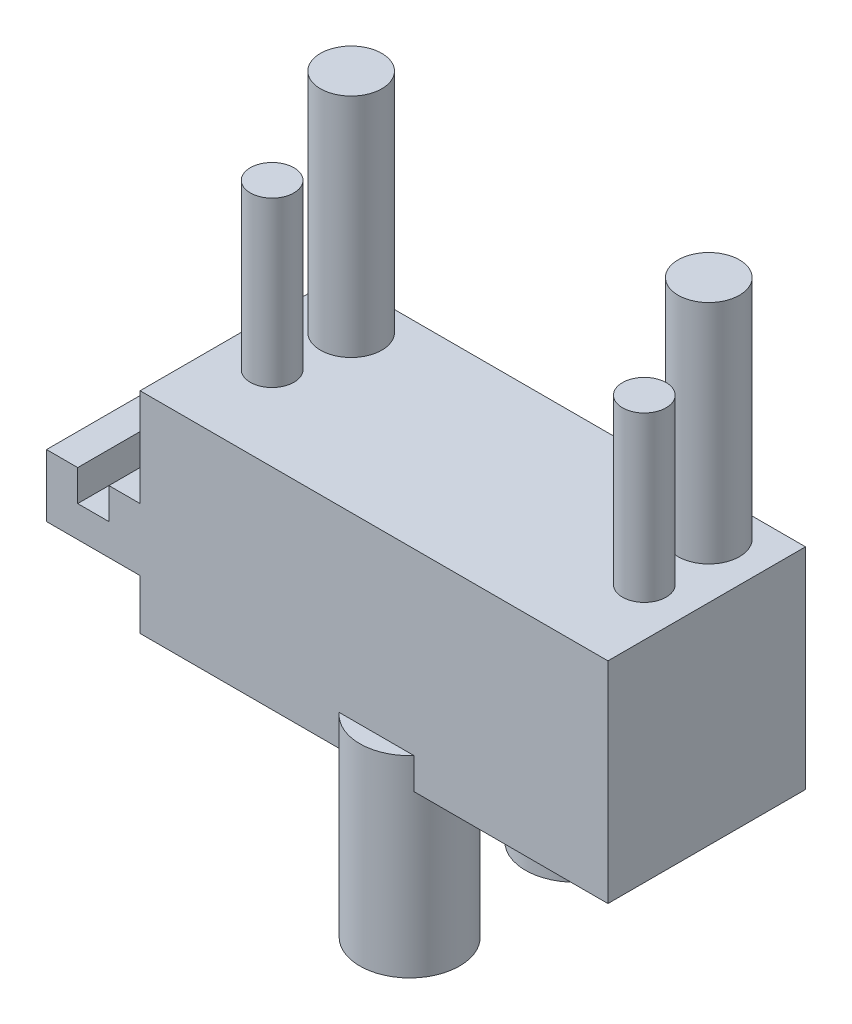
ISO-10303-21;
HEADER;
FILE_DESCRIPTION(('STEP AP214'),'2;1');
FILE_NAME('part.step','',(''),(''),'','','');
FILE_SCHEMA(('AUTOMOTIVE_DESIGN { 1 0 10303 214 1 1 1 1 }'));
ENDSEC;
DATA;
#1=APPLICATION_CONTEXT('core data for automotive mechanical design processes');
#2=APPLICATION_PROTOCOL_DEFINITION('international standard','automotive_design',2000,#1);
#3=PRODUCT_CONTEXT('',#1,'mechanical');
#4=PRODUCT('Part','Part','',(#3));
#5=PRODUCT_RELATED_PRODUCT_CATEGORY('part','',(#4));
#6=PRODUCT_DEFINITION_FORMATION('','',#4);
#7=PRODUCT_DEFINITION_CONTEXT('part definition',#1,'design');
#8=PRODUCT_DEFINITION('design','',#6,#7);
#9=PRODUCT_DEFINITION_SHAPE('','',#8);
#10=(LENGTH_UNIT() NAMED_UNIT(*) SI_UNIT(.MILLI.,.METRE.));
#11=(NAMED_UNIT(*) PLANE_ANGLE_UNIT() SI_UNIT($,.RADIAN.));
#12=(NAMED_UNIT(*) SI_UNIT($,.STERADIAN.) SOLID_ANGLE_UNIT());
#13=UNCERTAINTY_MEASURE_WITH_UNIT(LENGTH_MEASURE(1.E-05),#10,'distance_accuracy_value','');
#14=(GEOMETRIC_REPRESENTATION_CONTEXT(3) GLOBAL_UNCERTAINTY_ASSIGNED_CONTEXT((#13)) GLOBAL_UNIT_ASSIGNED_CONTEXT((#10,
#11,#12)) REPRESENTATION_CONTEXT('',''));
#15=CARTESIAN_POINT('',(0.,0.,0.));
#16=DIRECTION('',(0.,0.,1.));
#17=DIRECTION('',(1.,0.,0.));
#18=AXIS2_PLACEMENT_3D('',#15,#16,#17);
#19=CARTESIAN_POINT('',(-44.6857896698205,-0.589999999999999,27.0794807115573));
#20=DIRECTION('',(0.,-1.,0.));
#21=DIRECTION('',(0.,0.,-1.));
#22=AXIS2_PLACEMENT_3D('',#19,#20,#21);
#23=PLANE('',#22);
#24=DIRECTION('',(1.,0.,0.));
#25=VECTOR('',#24,1.);
#26=CARTESIAN_POINT('',(-44.6857896698205,-0.590000000000001,17.5794807115573));
#27=LINE('',#26,#25);
#28=CARTESIAN_POINT('',(-41.6857896698205,-0.590000000000001,17.5794807115573));
#29=VERTEX_POINT('',#28);
#30=CARTESIAN_POINT('',(-40.1857896698205,-0.590000000000001,17.5794807115573));
#31=VERTEX_POINT('',#30);
#32=EDGE_CURVE('E202',#29,#31,#27,.T.);
#33=ORIENTED_EDGE('',*,*,#32,.F.);
#34=DIRECTION('',(0.,0.,-1.));
#35=VECTOR('',#34,1.);
#36=CARTESIAN_POINT('',(-41.6857896698205,-0.589999999999999,27.0794807115573));
#37=LINE('',#36,#35);
#38=CARTESIAN_POINT('',(-41.6857896698205,-0.589999999999999,27.0794807115573));
#39=VERTEX_POINT('',#38);
#40=EDGE_CURVE('E152',#39,#29,#37,.T.);
#41=ORIENTED_EDGE('',*,*,#40,.F.);
#42=DIRECTION('',(1.,0.,0.));
#43=VECTOR('',#42,1.);
#44=CARTESIAN_POINT('',(-44.6857896698205,-0.589999999999999,27.0794807115573));
#45=LINE('',#44,#43);
#46=CARTESIAN_POINT('',(-40.1857896698205,-0.59,27.0794807115573));
#47=VERTEX_POINT('',#46);
#48=EDGE_CURVE('E205',#39,#47,#45,.T.);
#49=ORIENTED_EDGE('',*,*,#48,.T.);
#50=DIRECTION('',(0.,0.,-1.));
#51=VECTOR('',#50,1.);
#52=CARTESIAN_POINT('',(-40.1857896698205,-0.589999999999999,27.0794807115573));
#53=LINE('',#52,#51);
#54=EDGE_CURVE('E178',#47,#31,#53,.T.);
#55=ORIENTED_EDGE('',*,*,#54,.T.);
#56=EDGE_LOOP('',(#33,#41,#49,#55));
#57=FACE_BOUND('',#56,.T.);
#58=ADVANCED_FACE('F35',(#57),#23,.F.);
#59=CARTESIAN_POINT('',(-40.1857896698205,1.5,24.5794807115573));
#60=DIRECTION('',(1.,0.,0.));
#61=DIRECTION('',(0.,0.,-1.));
#62=AXIS2_PLACEMENT_3D('',#59,#60,#61);
#63=PLANE('',#62);
#64=DIRECTION('',(0.,0.,1.));
#65=VECTOR('',#64,1.);
#66=CARTESIAN_POINT('',(-40.1857896698205,-3.59,27.0794807115573));
#67=LINE('',#66,#65);
#68=CARTESIAN_POINT('',(-40.1857896698205,-3.59,17.5794807115573));
#69=VERTEX_POINT('',#68);
#70=CARTESIAN_POINT('',(-40.1857896698205,-3.59,27.0794807115573));
#71=VERTEX_POINT('',#70);
#72=EDGE_CURVE('E187',#69,#71,#67,.T.);
#73=ORIENTED_EDGE('',*,*,#72,.F.);
#74=DIRECTION('',(0.,-1.,0.));
#75=VECTOR('',#74,1.);
#76=CARTESIAN_POINT('',(-40.1857896698205,1.5,17.5794807115573));
#77=LINE('',#76,#75);
#78=CARTESIAN_POINT('',(-40.1857896698205,-6.,17.5794807115573));
#79=VERTEX_POINT('',#78);
#80=EDGE_CURVE('E278',#69,#79,#77,.T.);
#81=ORIENTED_EDGE('',*,*,#80,.T.);
#82=DIRECTION('',(0.,0.,1.));
#83=VECTOR('',#82,1.);
#84=CARTESIAN_POINT('',(-40.1857896698205,-6.,0.));
#85=LINE('',#84,#83);
#86=CARTESIAN_POINT('',(-40.1857896698205,-6.,27.0794807115573));
#87=VERTEX_POINT('',#86);
#88=EDGE_CURVE('E248',#79,#87,#85,.T.);
#89=ORIENTED_EDGE('',*,*,#88,.T.);
#90=DIRECTION('',(0.,-1.,0.));
#91=VECTOR('',#90,1.);
#92=CARTESIAN_POINT('',(-40.1857896698205,1.5,27.0794807115573));
#93=LINE('',#92,#91);
#94=EDGE_CURVE('E58',#71,#87,#93,.T.);
#95=ORIENTED_EDGE('',*,*,#94,.F.);
#96=EDGE_LOOP('',(#73,#81,#89,#95));
#97=FACE_BOUND('',#96,.T.);
#98=ADVANCED_FACE('F37',(#97),#63,.F.);
#99=ORIENTED_EDGE('',*,*,#54,.F.);
#100=CARTESIAN_POINT('',(-40.1857896698205,4.11,27.0794807115573));
#101=VERTEX_POINT('',#100);
#102=EDGE_CURVE('E262',#101,#47,#93,.T.);
#103=ORIENTED_EDGE('',*,*,#102,.F.);
#104=DIRECTION('',(0.,0.,1.));
#105=VECTOR('',#104,1.);
#106=CARTESIAN_POINT('',(-40.1857896698205,4.11,17.5794807115573));
#107=LINE('',#106,#105);
#108=CARTESIAN_POINT('',(-40.1857896698205,4.11,17.5794807115573));
#109=VERTEX_POINT('',#108);
#110=EDGE_CURVE('E226',#109,#101,#107,.T.);
#111=ORIENTED_EDGE('',*,*,#110,.F.);
#112=EDGE_CURVE('E279',#109,#31,#77,.T.);
#113=ORIENTED_EDGE('',*,*,#112,.T.);
#114=EDGE_LOOP('',(#99,#103,#111,#113));
#115=FACE_BOUND('',#114,.T.);
#116=ADVANCED_FACE('F335',(#115),#63,.F.);
#117=CARTESIAN_POINT('',(-37.5357896698205,15.,19.5794807115573));
#118=DIRECTION('',(0.,-1.,0.));
#119=DIRECTION('',(0.,0.,-1.));
#120=AXIS2_PLACEMENT_3D('',#117,#118,#119);
#121=CYLINDRICAL_SURFACE('',#120,1.475);
#122=CARTESIAN_POINT('',(-37.5357896698205,4.11,19.5794807115573));
#123=DIRECTION('',(0.,1.,0.));
#124=DIRECTION('',(0.,0.,1.));
#125=AXIS2_PLACEMENT_3D('',#122,#123,#124);
#126=CIRCLE('',#125,1.475);
#127=CARTESIAN_POINT('',(-37.5357896698205,4.11,21.0544807115573));
#128=VERTEX_POINT('',#127);
#129=EDGE_CURVE('E245',#128,#128,#126,.T.);
#130=ORIENTED_EDGE('',*,*,#129,.T.);
#131=EDGE_LOOP('',(#130));
#132=FACE_BOUND('',#131,.T.);
#133=CARTESIAN_POINT('',(-37.5357896698205,15.,19.5794807115573));
#134=DIRECTION('',(0.,1.,0.));
#135=DIRECTION('',(0.,0.,1.));
#136=AXIS2_PLACEMENT_3D('',#133,#134,#135);
#137=CIRCLE('',#136,1.475);
#138=CARTESIAN_POINT('',(-37.5357896698205,15.,21.0544807115573));
#139=VERTEX_POINT('',#138);
#140=EDGE_CURVE('E275',#139,#139,#137,.T.);
#141=ORIENTED_EDGE('',*,*,#140,.F.);
#142=EDGE_LOOP('',(#141));
#143=FACE_BOUND('',#142,.T.);
#144=ADVANCED_FACE('F413',(#132,#143),#121,.T.);
#145=CARTESIAN_POINT('',(-37.5357896698205,15.,19.5794807115573));
#146=DIRECTION('',(0.,1.,0.));
#147=DIRECTION('',(0.,0.,1.));
#148=AXIS2_PLACEMENT_3D('',#145,#146,#147);
#149=PLANE('',#148);
#150=ORIENTED_EDGE('',*,*,#140,.T.);
#151=EDGE_LOOP('',(#150));
#152=FACE_BOUND('',#151,.T.);
#153=ADVANCED_FACE('F567',(#152),#149,.T.);
#154=CARTESIAN_POINT('',(0.,4.11,0.));
#155=DIRECTION('',(0.,1.,0.));
#156=DIRECTION('',(0.,0.,1.));
#157=AXIS2_PLACEMENT_3D('',#154,#155,#156);
#158=PLANE('',#157);
#159=ORIENTED_EDGE('',*,*,#129,.F.);
#160=EDGE_LOOP('',(#159));
#161=FACE_BOUND('',#160,.T.);
#162=CARTESIAN_POINT('',(-20.3357896698205,4.11,19.5794807115573));
#163=DIRECTION('',(0.,1.,0.));
#164=DIRECTION('',(0.,0.,1.));
#165=AXIS2_PLACEMENT_3D('',#162,#163,#164);
#166=CIRCLE('',#165,1.475);
#167=CARTESIAN_POINT('',(-20.3357896698205,4.11,21.0544807115573));
#168=VERTEX_POINT('',#167);
#169=EDGE_CURVE('E242',#168,#168,#166,.T.);
#170=ORIENTED_EDGE('',*,*,#169,.F.);
#171=EDGE_LOOP('',(#170));
#172=FACE_BOUND('',#171,.T.);
#173=CARTESIAN_POINT('',(-37.8857896698205,4.11,23.0294807115573));
#174=DIRECTION('',(0.,1.,0.));
#175=DIRECTION('',(0.,0.,1.));
#176=AXIS2_PLACEMENT_3D('',#173,#174,#175);
#177=CIRCLE('',#176,1.05);
#178=CARTESIAN_POINT('',(-37.8857896698205,4.11,24.0794807115573));
#179=VERTEX_POINT('',#178);
#180=EDGE_CURVE('E239',#179,#179,#177,.T.);
#181=ORIENTED_EDGE('',*,*,#180,.F.);
#182=EDGE_LOOP('',(#181));
#183=FACE_BOUND('',#182,.T.);
#184=CARTESIAN_POINT('',(-19.9857896698205,4.11,23.0294807115573));
#185=DIRECTION('',(0.,1.,0.));
#186=DIRECTION('',(0.,0.,1.));
#187=AXIS2_PLACEMENT_3D('',#184,#185,#186);
#188=CIRCLE('',#187,1.05);
#189=CARTESIAN_POINT('',(-19.9857896698205,4.11,24.0794807115573));
#190=VERTEX_POINT('',#189);
#191=EDGE_CURVE('E238',#190,#190,#188,.T.);
#192=ORIENTED_EDGE('',*,*,#191,.F.);
#193=EDGE_LOOP('',(#192));
#194=FACE_BOUND('',#193,.T.);
#195=ORIENTED_EDGE('',*,*,#110,.T.);
#196=DIRECTION('',(1.,0.,0.));
#197=VECTOR('',#196,1.);
#198=CARTESIAN_POINT('',(-40.1857896698205,4.11,27.0794807115573));
#199=LINE('',#198,#197);
#200=CARTESIAN_POINT('',(-17.6857896698205,4.11,27.0794807115573));
#201=VERTEX_POINT('',#200);
#202=EDGE_CURVE('E229',#101,#201,#199,.T.);
#203=ORIENTED_EDGE('',*,*,#202,.T.);
#204=DIRECTION('',(0.,0.,-1.));
#205=VECTOR('',#204,1.);
#206=CARTESIAN_POINT('',(-17.6857896698205,4.11,17.5794807115573));
#207=LINE('',#206,#205);
#208=CARTESIAN_POINT('',(-17.6857896698205,4.11,17.5794807115573));
#209=VERTEX_POINT('',#208);
#210=EDGE_CURVE('E232',#201,#209,#207,.T.);
#211=ORIENTED_EDGE('',*,*,#210,.T.);
#212=DIRECTION('',(-1.,0.,0.));
#213=VECTOR('',#212,1.);
#214=CARTESIAN_POINT('',(-40.1857896698205,4.11,17.5794807115573));
#215=LINE('',#214,#213);
#216=EDGE_CURVE('E235',#209,#109,#215,.T.);
#217=ORIENTED_EDGE('',*,*,#216,.T.);
#218=EDGE_LOOP('',(#195,#203,#211,#217));
#219=FACE_BOUND('',#218,.T.);
#220=ADVANCED_FACE('F338',(#161,#172,#183,#194,#219),#158,.T.);
#221=CARTESIAN_POINT('',(-19.9857896698205,12.,23.0294807115573));
#222=DIRECTION('',(0.,1.,0.));
#223=DIRECTION('',(0.,0.,1.));
#224=AXIS2_PLACEMENT_3D('',#221,#222,#223);
#225=PLANE('',#224);
#226=CARTESIAN_POINT('',(-19.9857896698205,12.,23.0294807115573));
#227=DIRECTION('',(0.,1.,0.));
#228=DIRECTION('',(0.,0.,1.));
#229=AXIS2_PLACEMENT_3D('',#226,#227,#228);
#230=CIRCLE('',#229,1.05);
#231=CARTESIAN_POINT('',(-19.9857896698205,12.,24.0794807115573));
#232=VERTEX_POINT('',#231);
#233=EDGE_CURVE('E265',#232,#232,#230,.T.);
#234=ORIENTED_EDGE('',*,*,#233,.T.);
#235=EDGE_LOOP('',(#234));
#236=FACE_BOUND('',#235,.T.);
#237=ADVANCED_FACE('F552',(#236),#225,.T.);
#238=CARTESIAN_POINT('',(-19.9857896698205,12.,23.0294807115573));
#239=DIRECTION('',(0.,-1.,0.));
#240=DIRECTION('',(0.,0.,-1.));
#241=AXIS2_PLACEMENT_3D('',#238,#239,#240);
#242=CYLINDRICAL_SURFACE('',#241,1.05);
#243=ORIENTED_EDGE('',*,*,#191,.T.);
#244=EDGE_LOOP('',(#243));
#245=FACE_BOUND('',#244,.T.);
#246=ORIENTED_EDGE('',*,*,#233,.F.);
#247=EDGE_LOOP('',(#246));
#248=FACE_BOUND('',#247,.T.);
#249=ADVANCED_FACE('F544',(#245,#248),#242,.T.);
#250=CARTESIAN_POINT('',(-37.8857896698205,12.,23.0294807115573));
#251=DIRECTION('',(0.,1.,0.));
#252=DIRECTION('',(0.,0.,1.));
#253=AXIS2_PLACEMENT_3D('',#250,#251,#252);
#254=PLANE('',#253);
#255=CARTESIAN_POINT('',(-37.8857896698205,12.,23.0294807115573));
#256=DIRECTION('',(0.,1.,0.));
#257=DIRECTION('',(0.,0.,1.));
#258=AXIS2_PLACEMENT_3D('',#255,#256,#257);
#259=CIRCLE('',#258,1.05);
#260=CARTESIAN_POINT('',(-37.8857896698205,12.,24.0794807115573));
#261=VERTEX_POINT('',#260);
#262=EDGE_CURVE('E269',#261,#261,#259,.T.);
#263=ORIENTED_EDGE('',*,*,#262,.T.);
#264=EDGE_LOOP('',(#263));
#265=FACE_BOUND('',#264,.T.);
#266=ADVANCED_FACE('F536',(#265),#254,.T.);
#267=CARTESIAN_POINT('',(-37.8857896698205,12.,23.0294807115573));
#268=DIRECTION('',(0.,-1.,0.));
#269=DIRECTION('',(0.,0.,-1.));
#270=AXIS2_PLACEMENT_3D('',#267,#268,#269);
#271=CYLINDRICAL_SURFACE('',#270,1.05);
#272=ORIENTED_EDGE('',*,*,#180,.T.);
#273=EDGE_LOOP('',(#272));
#274=FACE_BOUND('',#273,.T.);
#275=ORIENTED_EDGE('',*,*,#262,.F.);
#276=EDGE_LOOP('',(#275));
#277=FACE_BOUND('',#276,.T.);
#278=ADVANCED_FACE('F527',(#274,#277),#271,.T.);
#279=CARTESIAN_POINT('',(-20.3357896698205,15.,19.5794807115573));
#280=DIRECTION('',(0.,1.,0.));
#281=DIRECTION('',(0.,0.,1.));
#282=AXIS2_PLACEMENT_3D('',#279,#280,#281);
#283=PLANE('',#282);
#284=CARTESIAN_POINT('',(-20.3357896698205,15.,19.5794807115573));
#285=DIRECTION('',(0.,1.,0.));
#286=DIRECTION('',(0.,0.,1.));
#287=AXIS2_PLACEMENT_3D('',#284,#285,#286);
#288=CIRCLE('',#287,1.475);
#289=CARTESIAN_POINT('',(-20.3357896698205,15.,21.0544807115573));
#290=VERTEX_POINT('',#289);
#291=EDGE_CURVE('E272',#290,#290,#288,.T.);
#292=ORIENTED_EDGE('',*,*,#291,.T.);
#293=EDGE_LOOP('',(#292));
#294=FACE_BOUND('',#293,.T.);
#295=ADVANCED_FACE('F518',(#294),#283,.T.);
#296=CARTESIAN_POINT('',(-20.3357896698205,15.,19.5794807115573));
#297=DIRECTION('',(0.,-1.,0.));
#298=DIRECTION('',(0.,0.,-1.));
#299=AXIS2_PLACEMENT_3D('',#296,#297,#298);
#300=CYLINDRICAL_SURFACE('',#299,1.475);
#301=ORIENTED_EDGE('',*,*,#169,.T.);
#302=EDGE_LOOP('',(#301));
#303=FACE_BOUND('',#302,.T.);
#304=ORIENTED_EDGE('',*,*,#291,.F.);
#305=EDGE_LOOP('',(#304));
#306=FACE_BOUND('',#305,.T.);
#307=ADVANCED_FACE('F508',(#303,#306),#300,.T.);
#308=CARTESIAN_POINT('',(0.,-6.,0.));
#309=DIRECTION('',(0.,-1.,0.));
#310=DIRECTION('',(0.,0.,-1.));
#311=AXIS2_PLACEMENT_3D('',#308,#309,#310);
#312=PLANE('',#311);
#313=CARTESIAN_POINT('',(-28.8107896698205,-6.,17.5194807115573));
#314=DIRECTION('',(0.,-1.,0.));
#315=DIRECTION('',(0.,0.,-1.));
#316=AXIS2_PLACEMENT_3D('',#313,#314,#315);
#317=CIRCLE('',#316,2.4);
#318=CARTESIAN_POINT('',(-26.4115397870447,-6.,17.5794807115573));
#319=VERTEX_POINT('',#318);
#320=CARTESIAN_POINT('',(-31.2100395525964,-6.,17.5794807115573));
#321=VERTEX_POINT('',#320);
#322=EDGE_CURVE('E215',#319,#321,#317,.T.);
#323=ORIENTED_EDGE('',*,*,#322,.F.);
#324=DIRECTION('',(1.,0.,0.));
#325=VECTOR('',#324,1.);
#326=CARTESIAN_POINT('',(0.,-6.,17.5794807115573));
#327=LINE('',#326,#325);
#328=CARTESIAN_POINT('',(-17.6857896698205,-6.,17.5794807115573));
#329=VERTEX_POINT('',#328);
#330=EDGE_CURVE('E250',#319,#329,#327,.T.);
#331=ORIENTED_EDGE('',*,*,#330,.T.);
#332=DIRECTION('',(0.,0.,1.));
#333=VECTOR('',#332,1.);
#334=CARTESIAN_POINT('',(-17.6857896698205,-6.,0.));
#335=LINE('',#334,#333);
#336=CARTESIAN_POINT('',(-17.6857896698205,-6.,27.0794807115573));
#337=VERTEX_POINT('',#336);
#338=EDGE_CURVE('E254',#329,#337,#335,.T.);
#339=ORIENTED_EDGE('',*,*,#338,.T.);
#340=DIRECTION('',(-1.,0.,0.));
#341=VECTOR('',#340,1.);
#342=CARTESIAN_POINT('',(0.,-6.,27.0794807115573));
#343=LINE('',#342,#341);
#344=CARTESIAN_POINT('',(-27.0130410778311,-6.,27.0794807115573));
#345=VERTEX_POINT('',#344);
#346=EDGE_CURVE('E258',#337,#345,#343,.T.);
#347=ORIENTED_EDGE('',*,*,#346,.T.);
#348=CARTESIAN_POINT('',(-28.8107896698205,-6.,25.4894807115573));
#349=DIRECTION('',(0.,-1.,0.));
#350=DIRECTION('',(0.,0.,-1.));
#351=AXIS2_PLACEMENT_3D('',#348,#349,#350);
#352=CIRCLE('',#351,2.4);
#353=CARTESIAN_POINT('',(-30.60853826181,-6.,27.0794807115573));
#354=VERTEX_POINT('',#353);
#355=EDGE_CURVE('E224',#354,#345,#352,.T.);
#356=ORIENTED_EDGE('',*,*,#355,.F.);
#357=EDGE_CURVE('E257',#354,#87,#343,.T.);
#358=ORIENTED_EDGE('',*,*,#357,.T.);
#359=ORIENTED_EDGE('',*,*,#88,.F.);
#360=EDGE_CURVE('E251',#79,#321,#327,.T.);
#361=ORIENTED_EDGE('',*,*,#360,.T.);
#362=EDGE_LOOP('',(#323,#331,#339,#347,#356,#358,#359,#361));
#363=FACE_BOUND('',#362,.T.);
#364=ADVANCED_FACE('F309',(#363),#312,.T.);
#365=CARTESIAN_POINT('',(-40.1857896698205,1.5,17.5794807115573));
#366=DIRECTION('',(0.,0.,1.));
#367=DIRECTION('',(1.,0.,0.));
#368=AXIS2_PLACEMENT_3D('',#365,#366,#367);
#369=PLANE('',#368);
#370=DIRECTION('',(-1.,0.,0.));
#371=VECTOR('',#370,1.);
#372=CARTESIAN_POINT('',(-41.6857896698205,-2.09,17.5794807115573));
#373=LINE('',#372,#371);
#374=CARTESIAN_POINT('',(-41.6857896698205,-2.09,17.5794807115573));
#375=VERTEX_POINT('',#374);
#376=CARTESIAN_POINT('',(-43.1857896698205,-2.09,17.5794807115573));
#377=VERTEX_POINT('',#376);
#378=EDGE_CURVE('E162',#375,#377,#373,.T.);
#379=ORIENTED_EDGE('',*,*,#378,.F.);
#380=DIRECTION('',(0.,1.,0.));
#381=VECTOR('',#380,1.);
#382=CARTESIAN_POINT('',(-41.6857896698205,-2.09,17.5794807115573));
#383=LINE('',#382,#381);
#384=EDGE_CURVE('E146',#375,#29,#383,.T.);
#385=ORIENTED_EDGE('',*,*,#384,.T.);
#386=ORIENTED_EDGE('',*,*,#32,.T.);
#387=ORIENTED_EDGE('',*,*,#112,.F.);
#388=ORIENTED_EDGE('',*,*,#216,.F.);
#389=DIRECTION('',(0.,-1.,0.));
#390=VECTOR('',#389,1.);
#391=CARTESIAN_POINT('',(-17.6857896698205,1.5,17.5794807115573));
#392=LINE('',#391,#390);
#393=EDGE_CURVE('E282',#209,#329,#392,.T.);
#394=ORIENTED_EDGE('',*,*,#393,.T.);
#395=ORIENTED_EDGE('',*,*,#330,.F.);
#396=DIRECTION('',(0.,-1.,0.));
#397=VECTOR('',#396,1.);
#398=CARTESIAN_POINT('',(-26.4115397870447,-4.5,17.5794807115573));
#399=LINE('',#398,#397);
#400=CARTESIAN_POINT('',(-26.4115397870447,-4.5,17.5794807115573));
#401=VERTEX_POINT('',#400);
#402=EDGE_CURVE('E43',#319,#401,#399,.F.);
#403=ORIENTED_EDGE('',*,*,#402,.T.);
#404=DIRECTION('',(1.,0.,0.));
#405=VECTOR('',#404,1.);
#406=CARTESIAN_POINT('',(-40.1857896698205,-4.5,17.5794807115573));
#407=LINE('',#406,#405);
#408=CARTESIAN_POINT('',(-31.2100395525964,-4.5,17.5794807115573));
#409=VERTEX_POINT('',#408);
#410=EDGE_CURVE('E295',#409,#401,#407,.T.);
#411=ORIENTED_EDGE('',*,*,#410,.F.);
#412=DIRECTION('',(0.,-1.,0.));
#413=VECTOR('',#412,1.);
#414=CARTESIAN_POINT('',(-31.2100395525964,-4.5,17.5794807115573));
#415=LINE('',#414,#413);
#416=EDGE_CURVE('E11',#409,#321,#415,.T.);
#417=ORIENTED_EDGE('',*,*,#416,.T.);
#418=ORIENTED_EDGE('',*,*,#360,.F.);
#419=ORIENTED_EDGE('',*,*,#80,.F.);
#420=DIRECTION('',(1.,0.,0.));
#421=VECTOR('',#420,1.);
#422=CARTESIAN_POINT('',(-44.6857896698205,-3.59,17.5794807115573));
#423=LINE('',#422,#421);
#424=CARTESIAN_POINT('',(-44.6857896698205,-3.59,17.5794807115573));
#425=VERTEX_POINT('',#424);
#426=EDGE_CURVE('E199',#425,#69,#423,.T.);
#427=ORIENTED_EDGE('',*,*,#426,.F.);
#428=DIRECTION('',(0.,-1.,0.));
#429=VECTOR('',#428,1.);
#430=CARTESIAN_POINT('',(-44.6857896698205,-0.590000000000001,17.5794807115573));
#431=LINE('',#430,#429);
#432=CARTESIAN_POINT('',(-44.6857896698205,-0.590000000000001,17.5794807115573));
#433=VERTEX_POINT('',#432);
#434=EDGE_CURVE('E189',#433,#425,#431,.T.);
#435=ORIENTED_EDGE('',*,*,#434,.F.);
#436=CARTESIAN_POINT('',(-43.1857896698205,-0.590000000000001,17.5794807115573));
#437=VERTEX_POINT('',#436);
#438=EDGE_CURVE('E203',#433,#437,#27,.T.);
#439=ORIENTED_EDGE('',*,*,#438,.T.);
#440=DIRECTION('',(0.,1.,0.));
#441=VECTOR('',#440,1.);
#442=CARTESIAN_POINT('',(-43.1857896698205,-2.09,17.5794807115573));
#443=LINE('',#442,#441);
#444=EDGE_CURVE('E50',#377,#437,#443,.T.);
#445=ORIENTED_EDGE('',*,*,#444,.F.);
#446=EDGE_LOOP('',(#379,#385,#386,#387,#388,#394,#395,#403,#411,#417,#418,#419,#427,#435,#439,#445));
#447=FACE_BOUND('',#446,.T.);
#448=ADVANCED_FACE('F167',(#447),#369,.F.);
#449=CARTESIAN_POINT('',(0.,1.5,27.0794807115573));
#450=DIRECTION('',(0.,0.,1.));
#451=DIRECTION('',(1.,0.,0.));
#452=AXIS2_PLACEMENT_3D('',#449,#450,#451);
#453=PLANE('',#452);
#454=DIRECTION('',(0.,1.,0.));
#455=VECTOR('',#454,1.);
#456=CARTESIAN_POINT('',(-41.6857896698205,-2.09,27.0794807115573));
#457=LINE('',#456,#455);
#458=CARTESIAN_POINT('',(-41.6857896698205,-2.09,27.0794807115573));
#459=VERTEX_POINT('',#458);
#460=EDGE_CURVE('E176',#459,#39,#457,.T.);
#461=ORIENTED_EDGE('',*,*,#460,.F.);
#462=DIRECTION('',(1.,0.,0.));
#463=VECTOR('',#462,1.);
#464=CARTESIAN_POINT('',(-41.6857896698205,-2.09,27.0794807115573));
#465=LINE('',#464,#463);
#466=CARTESIAN_POINT('',(-43.1857896698205,-2.09,27.0794807115573));
#467=VERTEX_POINT('',#466);
#468=EDGE_CURVE('E156',#467,#459,#465,.T.);
#469=ORIENTED_EDGE('',*,*,#468,.F.);
#470=DIRECTION('',(0.,1.,0.));
#471=VECTOR('',#470,1.);
#472=CARTESIAN_POINT('',(-43.1857896698205,-2.09,27.0794807115573));
#473=LINE('',#472,#471);
#474=CARTESIAN_POINT('',(-43.1857896698205,-0.589999999999999,27.0794807115573));
#475=VERTEX_POINT('',#474);
#476=EDGE_CURVE('E179',#467,#475,#473,.T.);
#477=ORIENTED_EDGE('',*,*,#476,.T.);
#478=CARTESIAN_POINT('',(-44.6857896698205,-0.589999999999999,27.0794807115573));
#479=VERTEX_POINT('',#478);
#480=EDGE_CURVE('E206',#479,#475,#45,.T.);
#481=ORIENTED_EDGE('',*,*,#480,.F.);
#482=DIRECTION('',(0.,1.,0.));
#483=VECTOR('',#482,1.);
#484=CARTESIAN_POINT('',(-44.6857896698205,-0.589999999999999,27.0794807115573));
#485=LINE('',#484,#483);
#486=CARTESIAN_POINT('',(-44.6857896698205,-3.59,27.0794807115573));
#487=VERTEX_POINT('',#486);
#488=EDGE_CURVE('E183',#487,#479,#485,.T.);
#489=ORIENTED_EDGE('',*,*,#488,.F.);
#490=DIRECTION('',(1.,0.,0.));
#491=VECTOR('',#490,1.);
#492=CARTESIAN_POINT('',(-44.6857896698205,-3.59,27.0794807115573));
#493=LINE('',#492,#491);
#494=EDGE_CURVE('E193',#487,#71,#493,.T.);
#495=ORIENTED_EDGE('',*,*,#494,.T.);
#496=ORIENTED_EDGE('',*,*,#94,.T.);
#497=ORIENTED_EDGE('',*,*,#357,.F.);
#498=DIRECTION('',(0.,-1.,0.));
#499=VECTOR('',#498,1.);
#500=CARTESIAN_POINT('',(-30.60853826181,-4.5,27.0794807115573));
#501=LINE('',#500,#499);
#502=CARTESIAN_POINT('',(-30.60853826181,-4.5,27.0794807115573));
#503=VERTEX_POINT('',#502);
#504=EDGE_CURVE('E293',#503,#354,#501,.T.);
#505=ORIENTED_EDGE('',*,*,#504,.F.);
#506=DIRECTION('',(1.,0.,0.));
#507=VECTOR('',#506,1.);
#508=CARTESIAN_POINT('',(0.,-4.5,27.0794807115573));
#509=LINE('',#508,#507);
#510=CARTESIAN_POINT('',(-27.0130410778311,-4.5,27.0794807115573));
#511=VERTEX_POINT('',#510);
#512=EDGE_CURVE('E285',#503,#511,#509,.T.);
#513=ORIENTED_EDGE('',*,*,#512,.T.);
#514=DIRECTION('',(0.,-1.,0.));
#515=VECTOR('',#514,1.);
#516=CARTESIAN_POINT('',(-27.0130410778311,-4.5,27.0794807115573));
#517=LINE('',#516,#515);
#518=EDGE_CURVE('E290',#345,#511,#517,.F.);
#519=ORIENTED_EDGE('',*,*,#518,.F.);
#520=ORIENTED_EDGE('',*,*,#346,.F.);
#521=DIRECTION('',(0.,-1.,0.));
#522=VECTOR('',#521,1.);
#523=CARTESIAN_POINT('',(-17.6857896698205,1.5,27.0794807115573));
#524=LINE('',#523,#522);
#525=EDGE_CURVE('E261',#201,#337,#524,.T.);
#526=ORIENTED_EDGE('',*,*,#525,.F.);
#527=ORIENTED_EDGE('',*,*,#202,.F.);
#528=ORIENTED_EDGE('',*,*,#102,.T.);
#529=ORIENTED_EDGE('',*,*,#48,.F.);
#530=EDGE_LOOP('',(#461,#469,#477,#481,#489,#495,#496,#497,#505,#513,#519,#520,#526,#527,#528,#529));
#531=FACE_BOUND('',#530,.T.);
#532=ADVANCED_FACE('F328',(#531),#453,.T.);
#533=CARTESIAN_POINT('',(-17.6857896698205,1.5,24.5794807115573));
#534=DIRECTION('',(-1.,0.,0.));
#535=DIRECTION('',(0.,0.,1.));
#536=AXIS2_PLACEMENT_3D('',#533,#534,#535);
#537=PLANE('',#536);
#538=ORIENTED_EDGE('',*,*,#393,.F.);
#539=ORIENTED_EDGE('',*,*,#210,.F.);
#540=ORIENTED_EDGE('',*,*,#525,.T.);
#541=ORIENTED_EDGE('',*,*,#338,.F.);
#542=EDGE_LOOP('',(#538,#539,#540,#541));
#543=FACE_BOUND('',#542,.T.);
#544=ADVANCED_FACE('F342',(#543),#537,.F.);
#545=CARTESIAN_POINT('',(-28.8107896698205,-4.5,25.4894807115573));
#546=DIRECTION('',(0.,-1.,0.));
#547=DIRECTION('',(0.,0.,-1.));
#548=AXIS2_PLACEMENT_3D('',#545,#546,#547);
#549=CYLINDRICAL_SURFACE('',#548,2.4);
#550=CARTESIAN_POINT('',(-28.8107896698205,-4.5,25.4894807115573));
#551=DIRECTION('',(0.,-1.,0.));
#552=DIRECTION('',(0.,0.,-1.));
#553=AXIS2_PLACEMENT_3D('',#550,#551,#552);
#554=CIRCLE('',#553,2.4);
#555=EDGE_CURVE('E221',#511,#503,#554,.T.);
#556=ORIENTED_EDGE('',*,*,#555,.T.);
#557=ORIENTED_EDGE('',*,*,#504,.T.);
#558=ORIENTED_EDGE('',*,*,#355,.T.);
#559=ORIENTED_EDGE('',*,*,#518,.T.);
#560=EDGE_LOOP('',(#556,#557,#558,#559));
#561=FACE_BOUND('',#560,.T.);
#562=CARTESIAN_POINT('',(-28.8107896698205,-13.76,25.4894807115573));
#563=DIRECTION('',(0.,-1.,0.));
#564=DIRECTION('',(0.,0.,-1.));
#565=AXIS2_PLACEMENT_3D('',#562,#563,#564);
#566=CIRCLE('',#565,2.4);
#567=CARTESIAN_POINT('',(-28.8107896698205,-13.76,23.0894807115573));
#568=VERTEX_POINT('',#567);
#569=EDGE_CURVE('E218',#568,#568,#566,.T.);
#570=ORIENTED_EDGE('',*,*,#569,.F.);
#571=EDGE_LOOP('',(#570));
#572=FACE_BOUND('',#571,.T.);
#573=ADVANCED_FACE('F347',(#561,#572),#549,.T.);
#574=CARTESIAN_POINT('',(-28.8107896698205,-4.5,25.4894807115573));
#575=DIRECTION('',(0.,-1.,0.));
#576=DIRECTION('',(0.,0.,-1.));
#577=AXIS2_PLACEMENT_3D('',#574,#575,#576);
#578=PLANE('',#577);
#579=ORIENTED_EDGE('',*,*,#512,.F.);
#580=ORIENTED_EDGE('',*,*,#555,.F.);
#581=EDGE_LOOP('',(#579,#580));
#582=FACE_BOUND('',#581,.T.);
#583=ADVANCED_FACE('F350',(#582),#578,.F.);
#584=CARTESIAN_POINT('',(-28.8107896698205,-13.76,25.4894807115573));
#585=DIRECTION('',(0.,-1.,0.));
#586=DIRECTION('',(0.,0.,-1.));
#587=AXIS2_PLACEMENT_3D('',#584,#585,#586);
#588=PLANE('',#587);
#589=ORIENTED_EDGE('',*,*,#569,.T.);
#590=EDGE_LOOP('',(#589));
#591=FACE_BOUND('',#590,.T.);
#592=ADVANCED_FACE('F352',(#591),#588,.T.);
#593=CARTESIAN_POINT('',(-28.8107896698205,-4.5,17.5194807115573));
#594=DIRECTION('',(0.,-1.,0.));
#595=DIRECTION('',(0.,0.,-1.));
#596=AXIS2_PLACEMENT_3D('',#593,#594,#595);
#597=CYLINDRICAL_SURFACE('',#596,2.4);
#598=CARTESIAN_POINT('',(-28.8107896698205,-13.76,17.5194807115573));
#599=DIRECTION('',(0.,-1.,0.));
#600=DIRECTION('',(0.,0.,-1.));
#601=AXIS2_PLACEMENT_3D('',#598,#599,#600);
#602=CIRCLE('',#601,2.4);
#603=CARTESIAN_POINT('',(-28.8107896698205,-13.76,15.1194807115573));
#604=VERTEX_POINT('',#603);
#605=EDGE_CURVE('E209',#604,#604,#602,.T.);
#606=ORIENTED_EDGE('',*,*,#605,.F.);
#607=EDGE_LOOP('',(#606));
#608=FACE_BOUND('',#607,.T.);
#609=ORIENTED_EDGE('',*,*,#416,.F.);
#610=CARTESIAN_POINT('',(-28.8107896698205,-4.5,17.5194807115573));
#611=DIRECTION('',(0.,-1.,0.));
#612=DIRECTION('',(0.,0.,-1.));
#613=AXIS2_PLACEMENT_3D('',#610,#611,#612);
#614=CIRCLE('',#613,2.4);
#615=EDGE_CURVE('E212',#409,#401,#614,.T.);
#616=ORIENTED_EDGE('',*,*,#615,.T.);
#617=ORIENTED_EDGE('',*,*,#402,.F.);
#618=ORIENTED_EDGE('',*,*,#322,.T.);
#619=EDGE_LOOP('',(#609,#616,#617,#618));
#620=FACE_BOUND('',#619,.T.);
#621=ADVANCED_FACE('F304',(#608,#620),#597,.T.);
#622=CARTESIAN_POINT('',(-28.8107896698205,-4.5,17.5194807115573));
#623=DIRECTION('',(0.,-1.,0.));
#624=DIRECTION('',(0.,0.,-1.));
#625=AXIS2_PLACEMENT_3D('',#622,#623,#624);
#626=PLANE('',#625);
#627=ORIENTED_EDGE('',*,*,#615,.F.);
#628=ORIENTED_EDGE('',*,*,#410,.T.);
#629=EDGE_LOOP('',(#627,#628));
#630=FACE_BOUND('',#629,.T.);
#631=ADVANCED_FACE('F303',(#630),#626,.F.);
#632=CARTESIAN_POINT('',(-28.8107896698205,-13.76,17.5194807115573));
#633=DIRECTION('',(0.,-1.,0.));
#634=DIRECTION('',(0.,0.,-1.));
#635=AXIS2_PLACEMENT_3D('',#632,#633,#634);
#636=PLANE('',#635);
#637=ORIENTED_EDGE('',*,*,#605,.T.);
#638=EDGE_LOOP('',(#637));
#639=FACE_BOUND('',#638,.T.);
#640=ADVANCED_FACE('F369',(#639),#636,.T.);
#641=ORIENTED_EDGE('',*,*,#480,.T.);
#642=DIRECTION('',(0.,0.,1.));
#643=VECTOR('',#642,1.);
#644=CARTESIAN_POINT('',(-43.1857896698205,-0.589999999999999,27.0794807115573));
#645=LINE('',#644,#643);
#646=EDGE_CURVE('E165',#437,#475,#645,.T.);
#647=ORIENTED_EDGE('',*,*,#646,.F.);
#648=ORIENTED_EDGE('',*,*,#438,.F.);
#649=DIRECTION('',(0.,0.,-1.));
#650=VECTOR('',#649,1.);
#651=CARTESIAN_POINT('',(-44.6857896698205,-0.589999999999999,27.0794807115573));
#652=LINE('',#651,#650);
#653=EDGE_CURVE('E186',#479,#433,#652,.T.);
#654=ORIENTED_EDGE('',*,*,#653,.F.);
#655=EDGE_LOOP('',(#641,#647,#648,#654));
#656=FACE_BOUND('',#655,.T.);
#657=ADVANCED_FACE('F325',(#656),#23,.F.);
#658=CARTESIAN_POINT('',(-44.6857896698205,-3.59,27.0794807115573));
#659=DIRECTION('',(0.,1.,0.));
#660=DIRECTION('',(0.,0.,1.));
#661=AXIS2_PLACEMENT_3D('',#658,#659,#660);
#662=PLANE('',#661);
#663=ORIENTED_EDGE('',*,*,#72,.T.);
#664=ORIENTED_EDGE('',*,*,#494,.F.);
#665=DIRECTION('',(0.,0.,1.));
#666=VECTOR('',#665,1.);
#667=CARTESIAN_POINT('',(-44.6857896698205,-3.59,27.0794807115573));
#668=LINE('',#667,#666);
#669=EDGE_CURVE('E191',#425,#487,#668,.T.);
#670=ORIENTED_EDGE('',*,*,#669,.F.);
#671=ORIENTED_EDGE('',*,*,#426,.T.);
#672=EDGE_LOOP('',(#663,#664,#670,#671));
#673=FACE_BOUND('',#672,.T.);
#674=ADVANCED_FACE('F317',(#673),#662,.F.);
#675=CARTESIAN_POINT('',(-44.6857896698205,0.,0.));
#676=DIRECTION('',(1.,0.,0.));
#677=DIRECTION('',(0.,0.,-1.));
#678=AXIS2_PLACEMENT_3D('',#675,#676,#677);
#679=PLANE('',#678);
#680=ORIENTED_EDGE('',*,*,#488,.T.);
#681=ORIENTED_EDGE('',*,*,#653,.T.);
#682=ORIENTED_EDGE('',*,*,#434,.T.);
#683=ORIENTED_EDGE('',*,*,#669,.T.);
#684=EDGE_LOOP('',(#680,#681,#682,#683));
#685=FACE_BOUND('',#684,.T.);
#686=ADVANCED_FACE('F321',(#685),#679,.F.);
#687=CARTESIAN_POINT('',(-41.6857896698205,-2.09,27.0794807115573));
#688=DIRECTION('',(1.,0.,0.));
#689=DIRECTION('',(0.,0.,-1.));
#690=AXIS2_PLACEMENT_3D('',#687,#688,#689);
#691=PLANE('',#690);
#692=ORIENTED_EDGE('',*,*,#40,.T.);
#693=ORIENTED_EDGE('',*,*,#384,.F.);
#694=DIRECTION('',(0.,0.,-1.));
#695=VECTOR('',#694,1.);
#696=CARTESIAN_POINT('',(-41.6857896698205,-2.09,27.0794807115573));
#697=LINE('',#696,#695);
#698=EDGE_CURVE('E149',#459,#375,#697,.T.);
#699=ORIENTED_EDGE('',*,*,#698,.F.);
#700=ORIENTED_EDGE('',*,*,#460,.T.);
#701=EDGE_LOOP('',(#692,#693,#699,#700));
#702=FACE_BOUND('',#701,.T.);
#703=ADVANCED_FACE('F148',(#702),#691,.F.);
#704=CARTESIAN_POINT('',(-43.1857896698205,-2.09,27.0794807115573));
#705=DIRECTION('',(-1.,0.,0.));
#706=DIRECTION('',(0.,0.,1.));
#707=AXIS2_PLACEMENT_3D('',#704,#705,#706);
#708=PLANE('',#707);
#709=ORIENTED_EDGE('',*,*,#646,.T.);
#710=ORIENTED_EDGE('',*,*,#476,.F.);
#711=DIRECTION('',(0.,0.,1.));
#712=VECTOR('',#711,1.);
#713=CARTESIAN_POINT('',(-43.1857896698205,-2.09,27.0794807115573));
#714=LINE('',#713,#712);
#715=EDGE_CURVE('E169',#377,#467,#714,.T.);
#716=ORIENTED_EDGE('',*,*,#715,.F.);
#717=ORIENTED_EDGE('',*,*,#444,.T.);
#718=EDGE_LOOP('',(#709,#710,#716,#717));
#719=FACE_BOUND('',#718,.T.);
#720=ADVANCED_FACE('F326',(#719),#708,.F.);
#721=CARTESIAN_POINT('',(0.,-2.09,0.));
#722=DIRECTION('',(0.,1.,0.));
#723=DIRECTION('',(0.,0.,1.));
#724=AXIS2_PLACEMENT_3D('',#721,#722,#723);
#725=PLANE('',#724);
#726=ORIENTED_EDGE('',*,*,#698,.T.);
#727=ORIENTED_EDGE('',*,*,#378,.T.);
#728=ORIENTED_EDGE('',*,*,#715,.T.);
#729=ORIENTED_EDGE('',*,*,#468,.T.);
#730=EDGE_LOOP('',(#726,#727,#728,#729));
#731=FACE_BOUND('',#730,.T.);
#732=ADVANCED_FACE('F160',(#731),#725,.T.);
#733=CLOSED_SHELL('',(#58,#98,#116,#144,#153,#220,#237,#249,#266,#278,#295,#307,#364,#448,#532,
#544,#573,#583,#592,#621,#631,#640,#657,#674,#686,#703,#720,#732));
#734=MANIFOLD_SOLID_BREP('B2',#733);
#735=ADVANCED_BREP_SHAPE_REPRESENTATION('',(#18,#734),#14);
#736=SHAPE_DEFINITION_REPRESENTATION(#9,#735);
ENDSEC;
END-ISO-10303-21;
